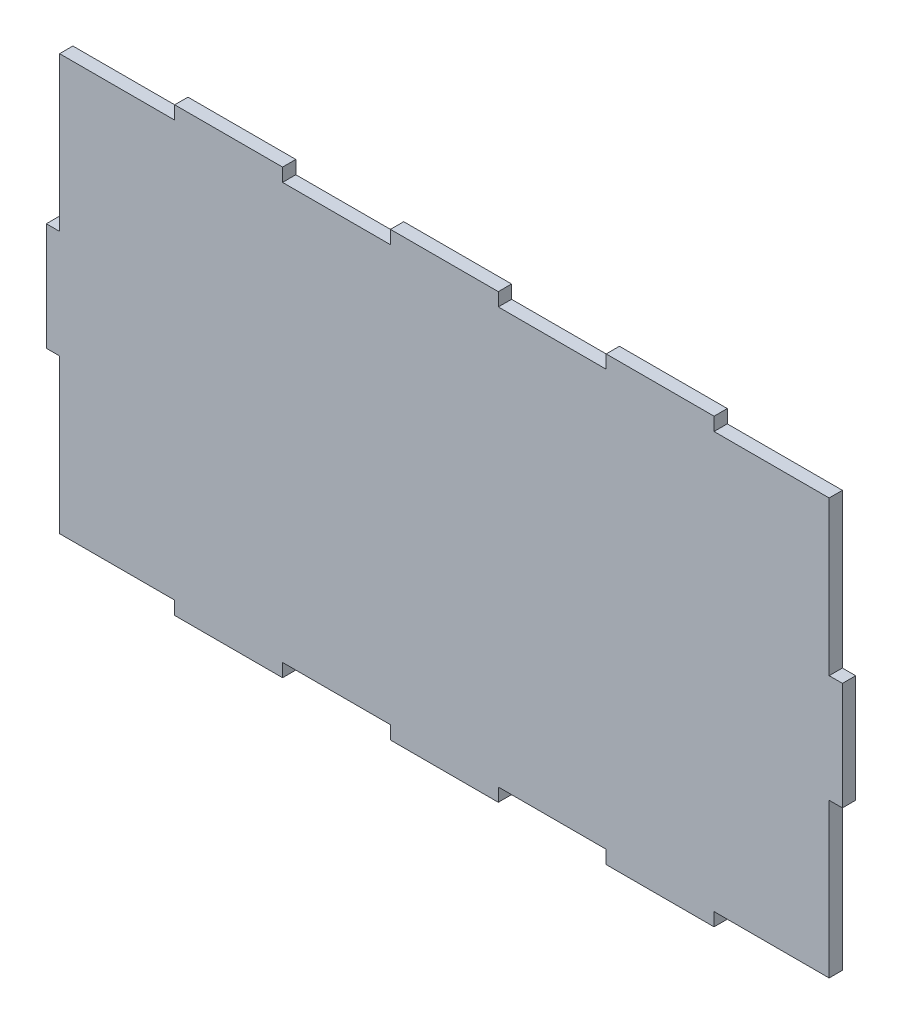
ISO-10303-21;
HEADER;
FILE_DESCRIPTION(('STEP AP214'),'2;1');
FILE_NAME('part.step','',(''),(''),'','','');
FILE_SCHEMA(('AUTOMOTIVE_DESIGN { 1 0 10303 214 1 1 1 1 }'));
ENDSEC;
DATA;
#1=APPLICATION_CONTEXT('core data for automotive mechanical design processes');
#2=APPLICATION_PROTOCOL_DEFINITION('international standard','automotive_design',2000,#1);
#3=PRODUCT_CONTEXT('',#1,'mechanical');
#4=PRODUCT('Part','Part','',(#3));
#5=PRODUCT_RELATED_PRODUCT_CATEGORY('part','',(#4));
#6=PRODUCT_DEFINITION_FORMATION('','',#4);
#7=PRODUCT_DEFINITION_CONTEXT('part definition',#1,'design');
#8=PRODUCT_DEFINITION('design','',#6,#7);
#9=PRODUCT_DEFINITION_SHAPE('','',#8);
#10=(LENGTH_UNIT() NAMED_UNIT(*) SI_UNIT(.MILLI.,.METRE.));
#11=(NAMED_UNIT(*) PLANE_ANGLE_UNIT() SI_UNIT($,.RADIAN.));
#12=(NAMED_UNIT(*) SI_UNIT($,.STERADIAN.) SOLID_ANGLE_UNIT());
#13=UNCERTAINTY_MEASURE_WITH_UNIT(LENGTH_MEASURE(1.E-05),#10,'distance_accuracy_value','');
#14=(GEOMETRIC_REPRESENTATION_CONTEXT(3) GLOBAL_UNCERTAINTY_ASSIGNED_CONTEXT((#13)) GLOBAL_UNIT_ASSIGNED_CONTEXT((#10,
#11,#12)) REPRESENTATION_CONTEXT('',''));
#15=CARTESIAN_POINT('',(0.,0.,0.));
#16=DIRECTION('',(0.,0.,1.));
#17=DIRECTION('',(1.,0.,0.));
#18=AXIS2_PLACEMENT_3D('',#15,#16,#17);
#19=CARTESIAN_POINT('',(289.,97.,3.));
#20=DIRECTION('',(1.,0.,0.));
#21=DIRECTION('',(0.,0.,-1.));
#22=AXIS2_PLACEMENT_3D('',#19,#20,#21);
#23=PLANE('',#22);
#24=DIRECTION('',(0.,-1.,0.));
#25=VECTOR('',#24,1.);
#26=CARTESIAN_POINT('',(289.,97.,0.));
#27=LINE('',#26,#25);
#28=CARTESIAN_POINT('',(289.,97.,0.));
#29=VERTEX_POINT('',#28);
#30=CARTESIAN_POINT('',(289.,62.195,0.));
#31=VERTEX_POINT('',#30);
#32=EDGE_CURVE('E301',#29,#31,#27,.T.);
#33=ORIENTED_EDGE('',*,*,#32,.T.);
#34=DIRECTION('',(0.,0.,-1.));
#35=VECTOR('',#34,1.);
#36=CARTESIAN_POINT('',(289.,62.195,3.));
#37=LINE('',#36,#35);
#38=CARTESIAN_POINT('',(289.,62.195,3.));
#39=VERTEX_POINT('',#38);
#40=EDGE_CURVE('E41',#39,#31,#37,.T.);
#41=ORIENTED_EDGE('',*,*,#40,.F.);
#42=DIRECTION('',(0.,-1.,0.));
#43=VECTOR('',#42,1.);
#44=CARTESIAN_POINT('',(289.,97.,3.));
#45=LINE('',#44,#43);
#46=CARTESIAN_POINT('',(289.,97.,3.));
#47=VERTEX_POINT('',#46);
#48=EDGE_CURVE('E177',#47,#39,#45,.T.);
#49=ORIENTED_EDGE('',*,*,#48,.F.);
#50=DIRECTION('',(0.,0.,-1.));
#51=VECTOR('',#50,1.);
#52=CARTESIAN_POINT('',(289.,97.,3.));
#53=LINE('',#52,#51);
#54=EDGE_CURVE('E11',#47,#29,#53,.T.);
#55=ORIENTED_EDGE('',*,*,#54,.T.);
#56=EDGE_LOOP('',(#33,#41,#49,#55));
#57=FACE_BOUND('',#56,.T.);
#58=ADVANCED_FACE('F33',(#57),#23,.F.);
#59=CARTESIAN_POINT('',(289.,62.195,3.));
#60=DIRECTION('',(0.,-1.,0.));
#61=DIRECTION('',(0.,0.,-1.));
#62=AXIS2_PLACEMENT_3D('',#59,#60,#61);
#63=PLANE('',#62);
#64=DIRECTION('',(-1.,0.,0.));
#65=VECTOR('',#64,1.);
#66=CARTESIAN_POINT('',(289.,62.195,0.));
#67=LINE('',#66,#65);
#68=CARTESIAN_POINT('',(286.,62.195,0.));
#69=VERTEX_POINT('',#68);
#70=EDGE_CURVE('E303',#31,#69,#67,.T.);
#71=ORIENTED_EDGE('',*,*,#70,.T.);
#72=DIRECTION('',(0.,0.,-1.));
#73=VECTOR('',#72,1.);
#74=CARTESIAN_POINT('',(286.,62.195,3.));
#75=LINE('',#74,#73);
#76=CARTESIAN_POINT('',(286.,62.195,3.));
#77=VERTEX_POINT('',#76);
#78=EDGE_CURVE('E463',#77,#69,#75,.T.);
#79=ORIENTED_EDGE('',*,*,#78,.F.);
#80=DIRECTION('',(-1.,0.,0.));
#81=VECTOR('',#80,1.);
#82=CARTESIAN_POINT('',(289.,62.195,3.));
#83=LINE('',#82,#81);
#84=EDGE_CURVE('E471',#39,#77,#83,.T.);
#85=ORIENTED_EDGE('',*,*,#84,.F.);
#86=ORIENTED_EDGE('',*,*,#40,.T.);
#87=EDGE_LOOP('',(#71,#79,#85,#86));
#88=FACE_BOUND('',#87,.T.);
#89=ADVANCED_FACE('F469',(#88),#63,.F.);
#90=CARTESIAN_POINT('',(286.,62.195,3.));
#91=DIRECTION('',(1.,0.,0.));
#92=DIRECTION('',(0.,0.,-1.));
#93=AXIS2_PLACEMENT_3D('',#90,#91,#92);
#94=PLANE('',#93);
#95=DIRECTION('',(0.,-1.,0.));
#96=VECTOR('',#95,1.);
#97=CARTESIAN_POINT('',(286.,62.195,0.));
#98=LINE('',#97,#96);
#99=CARTESIAN_POINT('',(286.,37.805,0.));
#100=VERTEX_POINT('',#99);
#101=EDGE_CURVE('E305',#69,#100,#98,.T.);
#102=ORIENTED_EDGE('',*,*,#101,.T.);
#103=DIRECTION('',(0.,0.,-1.));
#104=VECTOR('',#103,1.);
#105=CARTESIAN_POINT('',(286.,37.805,3.));
#106=LINE('',#105,#104);
#107=CARTESIAN_POINT('',(286.,37.805,3.));
#108=VERTEX_POINT('',#107);
#109=EDGE_CURVE('E460',#108,#100,#106,.T.);
#110=ORIENTED_EDGE('',*,*,#109,.F.);
#111=DIRECTION('',(0.,-1.,0.));
#112=VECTOR('',#111,1.);
#113=CARTESIAN_POINT('',(286.,62.195,3.));
#114=LINE('',#113,#112);
#115=EDGE_CURVE('E489',#77,#108,#114,.T.);
#116=ORIENTED_EDGE('',*,*,#115,.F.);
#117=ORIENTED_EDGE('',*,*,#78,.T.);
#118=EDGE_LOOP('',(#102,#110,#116,#117));
#119=FACE_BOUND('',#118,.T.);
#120=ADVANCED_FACE('F480',(#119),#94,.F.);
#121=CARTESIAN_POINT('',(286.,37.805,3.));
#122=DIRECTION('',(0.,1.,0.));
#123=DIRECTION('',(0.,0.,1.));
#124=AXIS2_PLACEMENT_3D('',#121,#122,#123);
#125=PLANE('',#124);
#126=DIRECTION('',(1.,0.,0.));
#127=VECTOR('',#126,1.);
#128=CARTESIAN_POINT('',(286.,37.805,0.));
#129=LINE('',#128,#127);
#130=CARTESIAN_POINT('',(289.,37.805,0.));
#131=VERTEX_POINT('',#130);
#132=EDGE_CURVE('E307',#100,#131,#129,.T.);
#133=ORIENTED_EDGE('',*,*,#132,.T.);
#134=DIRECTION('',(0.,0.,-1.));
#135=VECTOR('',#134,1.);
#136=CARTESIAN_POINT('',(289.,37.805,3.));
#137=LINE('',#136,#135);
#138=CARTESIAN_POINT('',(289.,37.805,3.));
#139=VERTEX_POINT('',#138);
#140=EDGE_CURVE('E457',#139,#131,#137,.T.);
#141=ORIENTED_EDGE('',*,*,#140,.F.);
#142=DIRECTION('',(1.,0.,0.));
#143=VECTOR('',#142,1.);
#144=CARTESIAN_POINT('',(286.,37.805,3.));
#145=LINE('',#144,#143);
#146=EDGE_CURVE('E486',#108,#139,#145,.T.);
#147=ORIENTED_EDGE('',*,*,#146,.F.);
#148=ORIENTED_EDGE('',*,*,#109,.T.);
#149=EDGE_LOOP('',(#133,#141,#147,#148));
#150=FACE_BOUND('',#149,.T.);
#151=ADVANCED_FACE('F484',(#150),#125,.F.);
#152=CARTESIAN_POINT('',(289.,13.415,3.));
#153=DIRECTION('',(1.,0.,0.));
#154=DIRECTION('',(0.,0.,-1.));
#155=AXIS2_PLACEMENT_3D('',#152,#153,#154);
#156=PLANE('',#155);
#157=DIRECTION('',(0.,-1.,0.));
#158=VECTOR('',#157,1.);
#159=CARTESIAN_POINT('',(289.,13.415,0.));
#160=LINE('',#159,#158);
#161=CARTESIAN_POINT('',(289.,3.,0.));
#162=VERTEX_POINT('',#161);
#163=EDGE_CURVE('E310',#131,#162,#160,.T.);
#164=ORIENTED_EDGE('',*,*,#163,.T.);
#165=DIRECTION('',(0.,0.,-1.));
#166=VECTOR('',#165,1.);
#167=CARTESIAN_POINT('',(289.,3.,3.));
#168=LINE('',#167,#166);
#169=CARTESIAN_POINT('',(289.,3.,3.));
#170=VERTEX_POINT('',#169);
#171=EDGE_CURVE('E454',#170,#162,#168,.T.);
#172=ORIENTED_EDGE('',*,*,#171,.F.);
#173=DIRECTION('',(0.,-1.,0.));
#174=VECTOR('',#173,1.);
#175=CARTESIAN_POINT('',(289.,37.805,3.));
#176=LINE('',#175,#174);
#177=EDGE_CURVE('E488',#139,#170,#176,.T.);
#178=ORIENTED_EDGE('',*,*,#177,.F.);
#179=ORIENTED_EDGE('',*,*,#140,.T.);
#180=EDGE_LOOP('',(#164,#172,#178,#179));
#181=FACE_BOUND('',#180,.T.);
#182=ADVANCED_FACE('F579',(#181),#156,.F.);
#183=CARTESIAN_POINT('',(289.,3.,3.));
#184=DIRECTION('',(0.,1.,0.));
#185=DIRECTION('',(0.,0.,1.));
#186=AXIS2_PLACEMENT_3D('',#183,#184,#185);
#187=PLANE('',#186);
#188=DIRECTION('',(1.,0.,0.));
#189=VECTOR('',#188,1.);
#190=CARTESIAN_POINT('',(289.,3.,0.));
#191=LINE('',#190,#189);
#192=CARTESIAN_POINT('',(315.025,3.,0.));
#193=VERTEX_POINT('',#192);
#194=EDGE_CURVE('E312',#162,#193,#191,.T.);
#195=ORIENTED_EDGE('',*,*,#194,.T.);
#196=DIRECTION('',(0.,0.,-1.));
#197=VECTOR('',#196,1.);
#198=CARTESIAN_POINT('',(315.025,3.,3.));
#199=LINE('',#198,#197);
#200=CARTESIAN_POINT('',(315.025,3.,3.));
#201=VERTEX_POINT('',#200);
#202=EDGE_CURVE('E451',#201,#193,#199,.T.);
#203=ORIENTED_EDGE('',*,*,#202,.F.);
#204=DIRECTION('',(1.,0.,0.));
#205=VECTOR('',#204,1.);
#206=CARTESIAN_POINT('',(289.,3.,3.));
#207=LINE('',#206,#205);
#208=EDGE_CURVE('E491',#170,#201,#207,.T.);
#209=ORIENTED_EDGE('',*,*,#208,.F.);
#210=ORIENTED_EDGE('',*,*,#171,.T.);
#211=EDGE_LOOP('',(#195,#203,#209,#210));
#212=FACE_BOUND('',#211,.T.);
#213=ADVANCED_FACE('F582',(#212),#187,.F.);
#214=CARTESIAN_POINT('',(315.025,3.,3.));
#215=DIRECTION('',(1.,0.,0.));
#216=DIRECTION('',(0.,0.,-1.));
#217=AXIS2_PLACEMENT_3D('',#214,#215,#216);
#218=PLANE('',#217);
#219=DIRECTION('',(0.,-1.,0.));
#220=VECTOR('',#219,1.);
#221=CARTESIAN_POINT('',(315.025,3.,0.));
#222=LINE('',#221,#220);
#223=CARTESIAN_POINT('',(315.025,0.,0.));
#224=VERTEX_POINT('',#223);
#225=EDGE_CURVE('E314',#193,#224,#222,.T.);
#226=ORIENTED_EDGE('',*,*,#225,.T.);
#227=DIRECTION('',(0.,0.,-1.));
#228=VECTOR('',#227,1.);
#229=CARTESIAN_POINT('',(315.025,0.,3.));
#230=LINE('',#229,#228);
#231=CARTESIAN_POINT('',(315.025,0.,3.));
#232=VERTEX_POINT('',#231);
#233=EDGE_CURVE('E448',#232,#224,#230,.T.);
#234=ORIENTED_EDGE('',*,*,#233,.F.);
#235=DIRECTION('',(0.,-1.,0.));
#236=VECTOR('',#235,1.);
#237=CARTESIAN_POINT('',(315.025,3.,3.));
#238=LINE('',#237,#236);
#239=EDGE_CURVE('E497',#201,#232,#238,.T.);
#240=ORIENTED_EDGE('',*,*,#239,.F.);
#241=ORIENTED_EDGE('',*,*,#202,.T.);
#242=EDGE_LOOP('',(#226,#234,#240,#241));
#243=FACE_BOUND('',#242,.T.);
#244=ADVANCED_FACE('F586',(#243),#218,.F.);
#245=CARTESIAN_POINT('',(315.025,0.,3.));
#246=DIRECTION('',(0.,1.,0.));
#247=DIRECTION('',(0.,0.,1.));
#248=AXIS2_PLACEMENT_3D('',#245,#246,#247);
#249=PLANE('',#248);
#250=DIRECTION('',(1.,0.,0.));
#251=VECTOR('',#250,1.);
#252=CARTESIAN_POINT('',(315.025,0.,0.));
#253=LINE('',#252,#251);
#254=CARTESIAN_POINT('',(339.415,0.,0.));
#255=VERTEX_POINT('',#254);
#256=EDGE_CURVE('E316',#224,#255,#253,.T.);
#257=ORIENTED_EDGE('',*,*,#256,.T.);
#258=DIRECTION('',(0.,0.,-1.));
#259=VECTOR('',#258,1.);
#260=CARTESIAN_POINT('',(339.415,0.,3.));
#261=LINE('',#260,#259);
#262=CARTESIAN_POINT('',(339.415,0.,3.));
#263=VERTEX_POINT('',#262);
#264=EDGE_CURVE('E445',#263,#255,#261,.T.);
#265=ORIENTED_EDGE('',*,*,#264,.F.);
#266=DIRECTION('',(1.,0.,0.));
#267=VECTOR('',#266,1.);
#268=CARTESIAN_POINT('',(315.025,0.,3.));
#269=LINE('',#268,#267);
#270=EDGE_CURVE('E499',#232,#263,#269,.T.);
#271=ORIENTED_EDGE('',*,*,#270,.F.);
#272=ORIENTED_EDGE('',*,*,#233,.T.);
#273=EDGE_LOOP('',(#257,#265,#271,#272));
#274=FACE_BOUND('',#273,.T.);
#275=ADVANCED_FACE('F590',(#274),#249,.F.);
#276=CARTESIAN_POINT('',(339.415,0.,3.));
#277=DIRECTION('',(-1.,0.,0.));
#278=DIRECTION('',(0.,0.,1.));
#279=AXIS2_PLACEMENT_3D('',#276,#277,#278);
#280=PLANE('',#279);
#281=DIRECTION('',(0.,1.,0.));
#282=VECTOR('',#281,1.);
#283=CARTESIAN_POINT('',(339.415,0.,0.));
#284=LINE('',#283,#282);
#285=CARTESIAN_POINT('',(339.415,3.,0.));
#286=VERTEX_POINT('',#285);
#287=EDGE_CURVE('E318',#255,#286,#284,.T.);
#288=ORIENTED_EDGE('',*,*,#287,.T.);
#289=DIRECTION('',(0.,0.,-1.));
#290=VECTOR('',#289,1.);
#291=CARTESIAN_POINT('',(339.415,3.,3.));
#292=LINE('',#291,#290);
#293=CARTESIAN_POINT('',(339.415,3.,3.));
#294=VERTEX_POINT('',#293);
#295=EDGE_CURVE('E442',#294,#286,#292,.T.);
#296=ORIENTED_EDGE('',*,*,#295,.F.);
#297=DIRECTION('',(0.,1.,0.));
#298=VECTOR('',#297,1.);
#299=CARTESIAN_POINT('',(339.415,0.,3.));
#300=LINE('',#299,#298);
#301=EDGE_CURVE('E501',#263,#294,#300,.T.);
#302=ORIENTED_EDGE('',*,*,#301,.F.);
#303=ORIENTED_EDGE('',*,*,#264,.T.);
#304=EDGE_LOOP('',(#288,#296,#302,#303));
#305=FACE_BOUND('',#304,.T.);
#306=ADVANCED_FACE('F594',(#305),#280,.F.);
#307=CARTESIAN_POINT('',(339.415,3.,3.));
#308=DIRECTION('',(0.,1.,0.));
#309=DIRECTION('',(0.,0.,1.));
#310=AXIS2_PLACEMENT_3D('',#307,#308,#309);
#311=PLANE('',#310);
#312=DIRECTION('',(1.,0.,0.));
#313=VECTOR('',#312,1.);
#314=CARTESIAN_POINT('',(339.415,3.,0.));
#315=LINE('',#314,#313);
#316=CARTESIAN_POINT('',(363.805,3.,0.));
#317=VERTEX_POINT('',#316);
#318=EDGE_CURVE('E320',#286,#317,#315,.T.);
#319=ORIENTED_EDGE('',*,*,#318,.T.);
#320=DIRECTION('',(0.,0.,-1.));
#321=VECTOR('',#320,1.);
#322=CARTESIAN_POINT('',(363.805,3.,3.));
#323=LINE('',#322,#321);
#324=CARTESIAN_POINT('',(363.805,3.,3.));
#325=VERTEX_POINT('',#324);
#326=EDGE_CURVE('E439',#325,#317,#323,.T.);
#327=ORIENTED_EDGE('',*,*,#326,.F.);
#328=DIRECTION('',(1.,0.,0.));
#329=VECTOR('',#328,1.);
#330=CARTESIAN_POINT('',(339.415,3.,3.));
#331=LINE('',#330,#329);
#332=EDGE_CURVE('E503',#294,#325,#331,.T.);
#333=ORIENTED_EDGE('',*,*,#332,.F.);
#334=ORIENTED_EDGE('',*,*,#295,.T.);
#335=EDGE_LOOP('',(#319,#327,#333,#334));
#336=FACE_BOUND('',#335,.T.);
#337=ADVANCED_FACE('F598',(#336),#311,.F.);
#338=CARTESIAN_POINT('',(363.805,3.,3.));
#339=DIRECTION('',(1.,0.,0.));
#340=DIRECTION('',(0.,0.,-1.));
#341=AXIS2_PLACEMENT_3D('',#338,#339,#340);
#342=PLANE('',#341);
#343=DIRECTION('',(0.,-1.,0.));
#344=VECTOR('',#343,1.);
#345=CARTESIAN_POINT('',(363.805,3.,0.));
#346=LINE('',#345,#344);
#347=CARTESIAN_POINT('',(363.805,0.,0.));
#348=VERTEX_POINT('',#347);
#349=EDGE_CURVE('E322',#317,#348,#346,.T.);
#350=ORIENTED_EDGE('',*,*,#349,.T.);
#351=DIRECTION('',(0.,0.,-1.));
#352=VECTOR('',#351,1.);
#353=CARTESIAN_POINT('',(363.805,0.,3.));
#354=LINE('',#353,#352);
#355=CARTESIAN_POINT('',(363.805,0.,3.));
#356=VERTEX_POINT('',#355);
#357=EDGE_CURVE('E436',#356,#348,#354,.T.);
#358=ORIENTED_EDGE('',*,*,#357,.F.);
#359=DIRECTION('',(0.,-1.,0.));
#360=VECTOR('',#359,1.);
#361=CARTESIAN_POINT('',(363.805,3.,3.));
#362=LINE('',#361,#360);
#363=EDGE_CURVE('E505',#325,#356,#362,.T.);
#364=ORIENTED_EDGE('',*,*,#363,.F.);
#365=ORIENTED_EDGE('',*,*,#326,.T.);
#366=EDGE_LOOP('',(#350,#358,#364,#365));
#367=FACE_BOUND('',#366,.T.);
#368=ADVANCED_FACE('F602',(#367),#342,.F.);
#369=CARTESIAN_POINT('',(363.805,0.,3.));
#370=DIRECTION('',(0.,1.,0.));
#371=DIRECTION('',(0.,0.,1.));
#372=AXIS2_PLACEMENT_3D('',#369,#370,#371);
#373=PLANE('',#372);
#374=DIRECTION('',(1.,0.,0.));
#375=VECTOR('',#374,1.);
#376=CARTESIAN_POINT('',(363.805,0.,0.));
#377=LINE('',#376,#375);
#378=CARTESIAN_POINT('',(388.195,0.,0.));
#379=VERTEX_POINT('',#378);
#380=EDGE_CURVE('E324',#348,#379,#377,.T.);
#381=ORIENTED_EDGE('',*,*,#380,.T.);
#382=DIRECTION('',(0.,0.,-1.));
#383=VECTOR('',#382,1.);
#384=CARTESIAN_POINT('',(388.195,0.,3.));
#385=LINE('',#384,#383);
#386=CARTESIAN_POINT('',(388.195,0.,3.));
#387=VERTEX_POINT('',#386);
#388=EDGE_CURVE('E433',#387,#379,#385,.T.);
#389=ORIENTED_EDGE('',*,*,#388,.F.);
#390=DIRECTION('',(1.,0.,0.));
#391=VECTOR('',#390,1.);
#392=CARTESIAN_POINT('',(363.805,0.,3.));
#393=LINE('',#392,#391);
#394=EDGE_CURVE('E507',#356,#387,#393,.T.);
#395=ORIENTED_EDGE('',*,*,#394,.F.);
#396=ORIENTED_EDGE('',*,*,#357,.T.);
#397=EDGE_LOOP('',(#381,#389,#395,#396));
#398=FACE_BOUND('',#397,.T.);
#399=ADVANCED_FACE('F606',(#398),#373,.F.);
#400=CARTESIAN_POINT('',(388.195,0.,3.));
#401=DIRECTION('',(-1.,0.,0.));
#402=DIRECTION('',(0.,0.,1.));
#403=AXIS2_PLACEMENT_3D('',#400,#401,#402);
#404=PLANE('',#403);
#405=DIRECTION('',(0.,1.,0.));
#406=VECTOR('',#405,1.);
#407=CARTESIAN_POINT('',(388.195,0.,0.));
#408=LINE('',#407,#406);
#409=CARTESIAN_POINT('',(388.195,3.,0.));
#410=VERTEX_POINT('',#409);
#411=EDGE_CURVE('E326',#379,#410,#408,.T.);
#412=ORIENTED_EDGE('',*,*,#411,.T.);
#413=DIRECTION('',(0.,0.,-1.));
#414=VECTOR('',#413,1.);
#415=CARTESIAN_POINT('',(388.195,3.,3.));
#416=LINE('',#415,#414);
#417=CARTESIAN_POINT('',(388.195,3.,3.));
#418=VERTEX_POINT('',#417);
#419=EDGE_CURVE('E430',#418,#410,#416,.T.);
#420=ORIENTED_EDGE('',*,*,#419,.F.);
#421=DIRECTION('',(0.,1.,0.));
#422=VECTOR('',#421,1.);
#423=CARTESIAN_POINT('',(388.195,0.,3.));
#424=LINE('',#423,#422);
#425=EDGE_CURVE('E509',#387,#418,#424,.T.);
#426=ORIENTED_EDGE('',*,*,#425,.F.);
#427=ORIENTED_EDGE('',*,*,#388,.T.);
#428=EDGE_LOOP('',(#412,#420,#426,#427));
#429=FACE_BOUND('',#428,.T.);
#430=ADVANCED_FACE('F610',(#429),#404,.F.);
#431=CARTESIAN_POINT('',(388.195,3.,3.));
#432=DIRECTION('',(0.,1.,0.));
#433=DIRECTION('',(0.,0.,1.));
#434=AXIS2_PLACEMENT_3D('',#431,#432,#433);
#435=PLANE('',#434);
#436=DIRECTION('',(1.,0.,0.));
#437=VECTOR('',#436,1.);
#438=CARTESIAN_POINT('',(388.195,3.,0.));
#439=LINE('',#438,#437);
#440=CARTESIAN_POINT('',(412.585,3.,0.));
#441=VERTEX_POINT('',#440);
#442=EDGE_CURVE('E328',#410,#441,#439,.T.);
#443=ORIENTED_EDGE('',*,*,#442,.T.);
#444=DIRECTION('',(0.,0.,-1.));
#445=VECTOR('',#444,1.);
#446=CARTESIAN_POINT('',(412.585,3.,3.));
#447=LINE('',#446,#445);
#448=CARTESIAN_POINT('',(412.585,3.,3.));
#449=VERTEX_POINT('',#448);
#450=EDGE_CURVE('E427',#449,#441,#447,.T.);
#451=ORIENTED_EDGE('',*,*,#450,.F.);
#452=DIRECTION('',(1.,0.,0.));
#453=VECTOR('',#452,1.);
#454=CARTESIAN_POINT('',(388.195,3.,3.));
#455=LINE('',#454,#453);
#456=EDGE_CURVE('E511',#418,#449,#455,.T.);
#457=ORIENTED_EDGE('',*,*,#456,.F.);
#458=ORIENTED_EDGE('',*,*,#419,.T.);
#459=EDGE_LOOP('',(#443,#451,#457,#458));
#460=FACE_BOUND('',#459,.T.);
#461=ADVANCED_FACE('F614',(#460),#435,.F.);
#462=CARTESIAN_POINT('',(412.585,3.,3.));
#463=DIRECTION('',(1.,0.,0.));
#464=DIRECTION('',(0.,0.,-1.));
#465=AXIS2_PLACEMENT_3D('',#462,#463,#464);
#466=PLANE('',#465);
#467=DIRECTION('',(0.,-1.,0.));
#468=VECTOR('',#467,1.);
#469=CARTESIAN_POINT('',(412.585,3.,0.));
#470=LINE('',#469,#468);
#471=CARTESIAN_POINT('',(412.585,0.,0.));
#472=VERTEX_POINT('',#471);
#473=EDGE_CURVE('E330',#441,#472,#470,.T.);
#474=ORIENTED_EDGE('',*,*,#473,.T.);
#475=DIRECTION('',(0.,0.,-1.));
#476=VECTOR('',#475,1.);
#477=CARTESIAN_POINT('',(412.585,0.,3.));
#478=LINE('',#477,#476);
#479=CARTESIAN_POINT('',(412.585,0.,3.));
#480=VERTEX_POINT('',#479);
#481=EDGE_CURVE('E424',#480,#472,#478,.T.);
#482=ORIENTED_EDGE('',*,*,#481,.F.);
#483=DIRECTION('',(0.,-1.,0.));
#484=VECTOR('',#483,1.);
#485=CARTESIAN_POINT('',(412.585,3.,3.));
#486=LINE('',#485,#484);
#487=EDGE_CURVE('E513',#449,#480,#486,.T.);
#488=ORIENTED_EDGE('',*,*,#487,.F.);
#489=ORIENTED_EDGE('',*,*,#450,.T.);
#490=EDGE_LOOP('',(#474,#482,#488,#489));
#491=FACE_BOUND('',#490,.T.);
#492=ADVANCED_FACE('F618',(#491),#466,.F.);
#493=CARTESIAN_POINT('',(412.585,0.,3.));
#494=DIRECTION('',(0.,1.,0.));
#495=DIRECTION('',(0.,0.,1.));
#496=AXIS2_PLACEMENT_3D('',#493,#494,#495);
#497=PLANE('',#496);
#498=DIRECTION('',(1.,0.,0.));
#499=VECTOR('',#498,1.);
#500=CARTESIAN_POINT('',(412.585,0.,0.));
#501=LINE('',#500,#499);
#502=CARTESIAN_POINT('',(436.975,0.,0.));
#503=VERTEX_POINT('',#502);
#504=EDGE_CURVE('E332',#472,#503,#501,.T.);
#505=ORIENTED_EDGE('',*,*,#504,.T.);
#506=DIRECTION('',(0.,0.,-1.));
#507=VECTOR('',#506,1.);
#508=CARTESIAN_POINT('',(436.975,0.,3.));
#509=LINE('',#508,#507);
#510=CARTESIAN_POINT('',(436.975,0.,3.));
#511=VERTEX_POINT('',#510);
#512=EDGE_CURVE('E421',#511,#503,#509,.T.);
#513=ORIENTED_EDGE('',*,*,#512,.F.);
#514=DIRECTION('',(1.,0.,0.));
#515=VECTOR('',#514,1.);
#516=CARTESIAN_POINT('',(412.585,0.,3.));
#517=LINE('',#516,#515);
#518=EDGE_CURVE('E515',#480,#511,#517,.T.);
#519=ORIENTED_EDGE('',*,*,#518,.F.);
#520=ORIENTED_EDGE('',*,*,#481,.T.);
#521=EDGE_LOOP('',(#505,#513,#519,#520));
#522=FACE_BOUND('',#521,.T.);
#523=ADVANCED_FACE('F622',(#522),#497,.F.);
#524=CARTESIAN_POINT('',(436.975,0.,3.));
#525=DIRECTION('',(-1.,0.,0.));
#526=DIRECTION('',(0.,0.,1.));
#527=AXIS2_PLACEMENT_3D('',#524,#525,#526);
#528=PLANE('',#527);
#529=DIRECTION('',(0.,1.,0.));
#530=VECTOR('',#529,1.);
#531=CARTESIAN_POINT('',(436.975,0.,0.));
#532=LINE('',#531,#530);
#533=CARTESIAN_POINT('',(436.975,3.,0.));
#534=VERTEX_POINT('',#533);
#535=EDGE_CURVE('E334',#503,#534,#532,.T.);
#536=ORIENTED_EDGE('',*,*,#535,.T.);
#537=DIRECTION('',(0.,0.,-1.));
#538=VECTOR('',#537,1.);
#539=CARTESIAN_POINT('',(436.975,3.,3.));
#540=LINE('',#539,#538);
#541=CARTESIAN_POINT('',(436.975,3.,3.));
#542=VERTEX_POINT('',#541);
#543=EDGE_CURVE('E418',#542,#534,#540,.T.);
#544=ORIENTED_EDGE('',*,*,#543,.F.);
#545=DIRECTION('',(0.,1.,0.));
#546=VECTOR('',#545,1.);
#547=CARTESIAN_POINT('',(436.975,0.,3.));
#548=LINE('',#547,#546);
#549=EDGE_CURVE('E517',#511,#542,#548,.T.);
#550=ORIENTED_EDGE('',*,*,#549,.F.);
#551=ORIENTED_EDGE('',*,*,#512,.T.);
#552=EDGE_LOOP('',(#536,#544,#550,#551));
#553=FACE_BOUND('',#552,.T.);
#554=ADVANCED_FACE('F626',(#553),#528,.F.);
#555=CARTESIAN_POINT('',(461.365,3.,3.));
#556=DIRECTION('',(0.,1.,0.));
#557=DIRECTION('',(0.,0.,1.));
#558=AXIS2_PLACEMENT_3D('',#555,#556,#557);
#559=PLANE('',#558);
#560=DIRECTION('',(1.,0.,0.));
#561=VECTOR('',#560,1.);
#562=CARTESIAN_POINT('',(461.365,3.,0.));
#563=LINE('',#562,#561);
#564=CARTESIAN_POINT('',(463.,3.,0.));
#565=VERTEX_POINT('',#564);
#566=EDGE_CURVE('E337',#534,#565,#563,.T.);
#567=ORIENTED_EDGE('',*,*,#566,.T.);
#568=DIRECTION('',(0.,0.,-1.));
#569=VECTOR('',#568,1.);
#570=CARTESIAN_POINT('',(463.,3.,3.));
#571=LINE('',#570,#569);
#572=CARTESIAN_POINT('',(463.,3.,3.));
#573=VERTEX_POINT('',#572);
#574=EDGE_CURVE('E415',#573,#565,#571,.T.);
#575=ORIENTED_EDGE('',*,*,#574,.F.);
#576=DIRECTION('',(1.,0.,0.));
#577=VECTOR('',#576,1.);
#578=CARTESIAN_POINT('',(436.975,3.,3.));
#579=LINE('',#578,#577);
#580=EDGE_CURVE('E519',#542,#573,#579,.T.);
#581=ORIENTED_EDGE('',*,*,#580,.F.);
#582=ORIENTED_EDGE('',*,*,#543,.T.);
#583=EDGE_LOOP('',(#567,#575,#581,#582));
#584=FACE_BOUND('',#583,.T.);
#585=ADVANCED_FACE('F630',(#584),#559,.F.);
#586=CARTESIAN_POINT('',(463.,3.,3.));
#587=DIRECTION('',(-1.,0.,0.));
#588=DIRECTION('',(0.,0.,1.));
#589=AXIS2_PLACEMENT_3D('',#586,#587,#588);
#590=PLANE('',#589);
#591=DIRECTION('',(0.,1.,0.));
#592=VECTOR('',#591,1.);
#593=CARTESIAN_POINT('',(463.,3.,0.));
#594=LINE('',#593,#592);
#595=CARTESIAN_POINT('',(463.,37.805,0.));
#596=VERTEX_POINT('',#595);
#597=EDGE_CURVE('E339',#565,#596,#594,.T.);
#598=ORIENTED_EDGE('',*,*,#597,.T.);
#599=DIRECTION('',(0.,0.,-1.));
#600=VECTOR('',#599,1.);
#601=CARTESIAN_POINT('',(463.,37.805,3.));
#602=LINE('',#601,#600);
#603=CARTESIAN_POINT('',(463.,37.805,3.));
#604=VERTEX_POINT('',#603);
#605=EDGE_CURVE('E412',#604,#596,#602,.T.);
#606=ORIENTED_EDGE('',*,*,#605,.F.);
#607=DIRECTION('',(0.,1.,0.));
#608=VECTOR('',#607,1.);
#609=CARTESIAN_POINT('',(463.,3.,3.));
#610=LINE('',#609,#608);
#611=EDGE_CURVE('E521',#573,#604,#610,.T.);
#612=ORIENTED_EDGE('',*,*,#611,.F.);
#613=ORIENTED_EDGE('',*,*,#574,.T.);
#614=EDGE_LOOP('',(#598,#606,#612,#613));
#615=FACE_BOUND('',#614,.T.);
#616=ADVANCED_FACE('F634',(#615),#590,.F.);
#617=CARTESIAN_POINT('',(463.,37.805,3.));
#618=DIRECTION('',(0.,1.,0.));
#619=DIRECTION('',(0.,0.,1.));
#620=AXIS2_PLACEMENT_3D('',#617,#618,#619);
#621=PLANE('',#620);
#622=DIRECTION('',(1.,0.,0.));
#623=VECTOR('',#622,1.);
#624=CARTESIAN_POINT('',(463.,37.805,0.));
#625=LINE('',#624,#623);
#626=CARTESIAN_POINT('',(466.,37.805,0.));
#627=VERTEX_POINT('',#626);
#628=EDGE_CURVE('E341',#596,#627,#625,.T.);
#629=ORIENTED_EDGE('',*,*,#628,.T.);
#630=DIRECTION('',(0.,0.,-1.));
#631=VECTOR('',#630,1.);
#632=CARTESIAN_POINT('',(466.,37.805,3.));
#633=LINE('',#632,#631);
#634=CARTESIAN_POINT('',(466.,37.805,3.));
#635=VERTEX_POINT('',#634);
#636=EDGE_CURVE('E409',#635,#627,#633,.T.);
#637=ORIENTED_EDGE('',*,*,#636,.F.);
#638=DIRECTION('',(1.,0.,0.));
#639=VECTOR('',#638,1.);
#640=CARTESIAN_POINT('',(463.,37.805,3.));
#641=LINE('',#640,#639);
#642=EDGE_CURVE('E523',#604,#635,#641,.T.);
#643=ORIENTED_EDGE('',*,*,#642,.F.);
#644=ORIENTED_EDGE('',*,*,#605,.T.);
#645=EDGE_LOOP('',(#629,#637,#643,#644));
#646=FACE_BOUND('',#645,.T.);
#647=ADVANCED_FACE('F638',(#646),#621,.F.);
#648=CARTESIAN_POINT('',(466.,37.805,3.));
#649=DIRECTION('',(-1.,0.,0.));
#650=DIRECTION('',(0.,0.,1.));
#651=AXIS2_PLACEMENT_3D('',#648,#649,#650);
#652=PLANE('',#651);
#653=DIRECTION('',(0.,1.,0.));
#654=VECTOR('',#653,1.);
#655=CARTESIAN_POINT('',(466.,37.805,0.));
#656=LINE('',#655,#654);
#657=CARTESIAN_POINT('',(466.,62.195,0.));
#658=VERTEX_POINT('',#657);
#659=EDGE_CURVE('E343',#627,#658,#656,.T.);
#660=ORIENTED_EDGE('',*,*,#659,.T.);
#661=DIRECTION('',(0.,0.,-1.));
#662=VECTOR('',#661,1.);
#663=CARTESIAN_POINT('',(466.,62.195,3.));
#664=LINE('',#663,#662);
#665=CARTESIAN_POINT('',(466.,62.195,3.));
#666=VERTEX_POINT('',#665);
#667=EDGE_CURVE('E406',#666,#658,#664,.T.);
#668=ORIENTED_EDGE('',*,*,#667,.F.);
#669=DIRECTION('',(0.,1.,0.));
#670=VECTOR('',#669,1.);
#671=CARTESIAN_POINT('',(466.,37.805,3.));
#672=LINE('',#671,#670);
#673=EDGE_CURVE('E525',#635,#666,#672,.T.);
#674=ORIENTED_EDGE('',*,*,#673,.F.);
#675=ORIENTED_EDGE('',*,*,#636,.T.);
#676=EDGE_LOOP('',(#660,#668,#674,#675));
#677=FACE_BOUND('',#676,.T.);
#678=ADVANCED_FACE('F642',(#677),#652,.F.);
#679=CARTESIAN_POINT('',(466.,62.195,3.));
#680=DIRECTION('',(0.,-1.,0.));
#681=DIRECTION('',(0.,0.,-1.));
#682=AXIS2_PLACEMENT_3D('',#679,#680,#681);
#683=PLANE('',#682);
#684=DIRECTION('',(-1.,0.,0.));
#685=VECTOR('',#684,1.);
#686=CARTESIAN_POINT('',(466.,62.195,0.));
#687=LINE('',#686,#685);
#688=CARTESIAN_POINT('',(463.,62.195,0.));
#689=VERTEX_POINT('',#688);
#690=EDGE_CURVE('E345',#658,#689,#687,.T.);
#691=ORIENTED_EDGE('',*,*,#690,.T.);
#692=DIRECTION('',(0.,0.,-1.));
#693=VECTOR('',#692,1.);
#694=CARTESIAN_POINT('',(463.,62.195,3.));
#695=LINE('',#694,#693);
#696=CARTESIAN_POINT('',(463.,62.195,3.));
#697=VERTEX_POINT('',#696);
#698=EDGE_CURVE('E403',#697,#689,#695,.T.);
#699=ORIENTED_EDGE('',*,*,#698,.F.);
#700=DIRECTION('',(-1.,0.,0.));
#701=VECTOR('',#700,1.);
#702=CARTESIAN_POINT('',(466.,62.195,3.));
#703=LINE('',#702,#701);
#704=EDGE_CURVE('E527',#666,#697,#703,.T.);
#705=ORIENTED_EDGE('',*,*,#704,.F.);
#706=ORIENTED_EDGE('',*,*,#667,.T.);
#707=EDGE_LOOP('',(#691,#699,#705,#706));
#708=FACE_BOUND('',#707,.T.);
#709=ADVANCED_FACE('F646',(#708),#683,.F.);
#710=CARTESIAN_POINT('',(463.,86.585,3.));
#711=DIRECTION('',(-1.,0.,0.));
#712=DIRECTION('',(0.,0.,1.));
#713=AXIS2_PLACEMENT_3D('',#710,#711,#712);
#714=PLANE('',#713);
#715=DIRECTION('',(0.,1.,0.));
#716=VECTOR('',#715,1.);
#717=CARTESIAN_POINT('',(463.,86.585,0.));
#718=LINE('',#717,#716);
#719=CARTESIAN_POINT('',(463.,97.,0.));
#720=VERTEX_POINT('',#719);
#721=EDGE_CURVE('E348',#689,#720,#718,.T.);
#722=ORIENTED_EDGE('',*,*,#721,.T.);
#723=DIRECTION('',(0.,0.,-1.));
#724=VECTOR('',#723,1.);
#725=CARTESIAN_POINT('',(463.,97.,3.));
#726=LINE('',#725,#724);
#727=CARTESIAN_POINT('',(463.,97.,3.));
#728=VERTEX_POINT('',#727);
#729=EDGE_CURVE('E400',#728,#720,#726,.T.);
#730=ORIENTED_EDGE('',*,*,#729,.F.);
#731=DIRECTION('',(0.,1.,0.));
#732=VECTOR('',#731,1.);
#733=CARTESIAN_POINT('',(463.,62.195,3.));
#734=LINE('',#733,#732);
#735=EDGE_CURVE('E529',#697,#728,#734,.T.);
#736=ORIENTED_EDGE('',*,*,#735,.F.);
#737=ORIENTED_EDGE('',*,*,#698,.T.);
#738=EDGE_LOOP('',(#722,#730,#736,#737));
#739=FACE_BOUND('',#738,.T.);
#740=ADVANCED_FACE('F650',(#739),#714,.F.);
#741=CARTESIAN_POINT('',(463.,97.,3.));
#742=DIRECTION('',(0.,-1.,0.));
#743=DIRECTION('',(0.,0.,-1.));
#744=AXIS2_PLACEMENT_3D('',#741,#742,#743);
#745=PLANE('',#744);
#746=DIRECTION('',(-1.,0.,0.));
#747=VECTOR('',#746,1.);
#748=CARTESIAN_POINT('',(463.,97.,0.));
#749=LINE('',#748,#747);
#750=CARTESIAN_POINT('',(436.975,97.,0.));
#751=VERTEX_POINT('',#750);
#752=EDGE_CURVE('E350',#720,#751,#749,.T.);
#753=ORIENTED_EDGE('',*,*,#752,.T.);
#754=DIRECTION('',(0.,0.,-1.));
#755=VECTOR('',#754,1.);
#756=CARTESIAN_POINT('',(436.975,97.,3.));
#757=LINE('',#756,#755);
#758=CARTESIAN_POINT('',(436.975,97.,3.));
#759=VERTEX_POINT('',#758);
#760=EDGE_CURVE('E397',#759,#751,#757,.T.);
#761=ORIENTED_EDGE('',*,*,#760,.F.);
#762=DIRECTION('',(-1.,0.,0.));
#763=VECTOR('',#762,1.);
#764=CARTESIAN_POINT('',(463.,97.,3.));
#765=LINE('',#764,#763);
#766=EDGE_CURVE('E531',#728,#759,#765,.T.);
#767=ORIENTED_EDGE('',*,*,#766,.F.);
#768=ORIENTED_EDGE('',*,*,#729,.T.);
#769=EDGE_LOOP('',(#753,#761,#767,#768));
#770=FACE_BOUND('',#769,.T.);
#771=ADVANCED_FACE('F654',(#770),#745,.F.);
#772=CARTESIAN_POINT('',(436.975,97.,3.));
#773=DIRECTION('',(-1.,0.,0.));
#774=DIRECTION('',(0.,0.,1.));
#775=AXIS2_PLACEMENT_3D('',#772,#773,#774);
#776=PLANE('',#775);
#777=DIRECTION('',(0.,1.,0.));
#778=VECTOR('',#777,1.);
#779=CARTESIAN_POINT('',(436.975,97.,0.));
#780=LINE('',#779,#778);
#781=CARTESIAN_POINT('',(436.975,100.,0.));
#782=VERTEX_POINT('',#781);
#783=EDGE_CURVE('E352',#751,#782,#780,.T.);
#784=ORIENTED_EDGE('',*,*,#783,.T.);
#785=DIRECTION('',(0.,0.,-1.));
#786=VECTOR('',#785,1.);
#787=CARTESIAN_POINT('',(436.975,100.,3.));
#788=LINE('',#787,#786);
#789=CARTESIAN_POINT('',(436.975,100.,3.));
#790=VERTEX_POINT('',#789);
#791=EDGE_CURVE('E394',#790,#782,#788,.T.);
#792=ORIENTED_EDGE('',*,*,#791,.F.);
#793=DIRECTION('',(0.,1.,0.));
#794=VECTOR('',#793,1.);
#795=CARTESIAN_POINT('',(436.975,97.,3.));
#796=LINE('',#795,#794);
#797=EDGE_CURVE('E533',#759,#790,#796,.T.);
#798=ORIENTED_EDGE('',*,*,#797,.F.);
#799=ORIENTED_EDGE('',*,*,#760,.T.);
#800=EDGE_LOOP('',(#784,#792,#798,#799));
#801=FACE_BOUND('',#800,.T.);
#802=ADVANCED_FACE('F658',(#801),#776,.F.);
#803=CARTESIAN_POINT('',(436.975,100.,3.));
#804=DIRECTION('',(0.,-1.,0.));
#805=DIRECTION('',(0.,0.,-1.));
#806=AXIS2_PLACEMENT_3D('',#803,#804,#805);
#807=PLANE('',#806);
#808=DIRECTION('',(-1.,0.,0.));
#809=VECTOR('',#808,1.);
#810=CARTESIAN_POINT('',(436.975,100.,0.));
#811=LINE('',#810,#809);
#812=CARTESIAN_POINT('',(412.585,100.,0.));
#813=VERTEX_POINT('',#812);
#814=EDGE_CURVE('E354',#782,#813,#811,.T.);
#815=ORIENTED_EDGE('',*,*,#814,.T.);
#816=DIRECTION('',(0.,0.,-1.));
#817=VECTOR('',#816,1.);
#818=CARTESIAN_POINT('',(412.585,100.,3.));
#819=LINE('',#818,#817);
#820=CARTESIAN_POINT('',(412.585,100.,3.));
#821=VERTEX_POINT('',#820);
#822=EDGE_CURVE('E391',#821,#813,#819,.T.);
#823=ORIENTED_EDGE('',*,*,#822,.F.);
#824=DIRECTION('',(-1.,0.,0.));
#825=VECTOR('',#824,1.);
#826=CARTESIAN_POINT('',(436.975,100.,3.));
#827=LINE('',#826,#825);
#828=EDGE_CURVE('E535',#790,#821,#827,.T.);
#829=ORIENTED_EDGE('',*,*,#828,.F.);
#830=ORIENTED_EDGE('',*,*,#791,.T.);
#831=EDGE_LOOP('',(#815,#823,#829,#830));
#832=FACE_BOUND('',#831,.T.);
#833=ADVANCED_FACE('F662',(#832),#807,.F.);
#834=CARTESIAN_POINT('',(412.585,100.,3.));
#835=DIRECTION('',(1.,0.,0.));
#836=DIRECTION('',(0.,0.,-1.));
#837=AXIS2_PLACEMENT_3D('',#834,#835,#836);
#838=PLANE('',#837);
#839=DIRECTION('',(0.,-1.,0.));
#840=VECTOR('',#839,1.);
#841=CARTESIAN_POINT('',(412.585,100.,0.));
#842=LINE('',#841,#840);
#843=CARTESIAN_POINT('',(412.585,97.,0.));
#844=VERTEX_POINT('',#843);
#845=EDGE_CURVE('E356',#813,#844,#842,.T.);
#846=ORIENTED_EDGE('',*,*,#845,.T.);
#847=DIRECTION('',(0.,0.,-1.));
#848=VECTOR('',#847,1.);
#849=CARTESIAN_POINT('',(412.585,97.,3.));
#850=LINE('',#849,#848);
#851=CARTESIAN_POINT('',(412.585,97.,3.));
#852=VERTEX_POINT('',#851);
#853=EDGE_CURVE('E388',#852,#844,#850,.T.);
#854=ORIENTED_EDGE('',*,*,#853,.F.);
#855=DIRECTION('',(0.,-1.,0.));
#856=VECTOR('',#855,1.);
#857=CARTESIAN_POINT('',(412.585,100.,3.));
#858=LINE('',#857,#856);
#859=EDGE_CURVE('E537',#821,#852,#858,.T.);
#860=ORIENTED_EDGE('',*,*,#859,.F.);
#861=ORIENTED_EDGE('',*,*,#822,.T.);
#862=EDGE_LOOP('',(#846,#854,#860,#861));
#863=FACE_BOUND('',#862,.T.);
#864=ADVANCED_FACE('F666',(#863),#838,.F.);
#865=CARTESIAN_POINT('',(412.585,97.,3.));
#866=DIRECTION('',(0.,-1.,0.));
#867=DIRECTION('',(0.,0.,-1.));
#868=AXIS2_PLACEMENT_3D('',#865,#866,#867);
#869=PLANE('',#868);
#870=DIRECTION('',(-1.,0.,0.));
#871=VECTOR('',#870,1.);
#872=CARTESIAN_POINT('',(412.585,97.,0.));
#873=LINE('',#872,#871);
#874=CARTESIAN_POINT('',(388.195,97.,0.));
#875=VERTEX_POINT('',#874);
#876=EDGE_CURVE('E358',#844,#875,#873,.T.);
#877=ORIENTED_EDGE('',*,*,#876,.T.);
#878=DIRECTION('',(0.,0.,-1.));
#879=VECTOR('',#878,1.);
#880=CARTESIAN_POINT('',(388.195,97.,3.));
#881=LINE('',#880,#879);
#882=CARTESIAN_POINT('',(388.195,97.,3.));
#883=VERTEX_POINT('',#882);
#884=EDGE_CURVE('E385',#883,#875,#881,.T.);
#885=ORIENTED_EDGE('',*,*,#884,.F.);
#886=DIRECTION('',(-1.,0.,0.));
#887=VECTOR('',#886,1.);
#888=CARTESIAN_POINT('',(412.585,97.,3.));
#889=LINE('',#888,#887);
#890=EDGE_CURVE('E539',#852,#883,#889,.T.);
#891=ORIENTED_EDGE('',*,*,#890,.F.);
#892=ORIENTED_EDGE('',*,*,#853,.T.);
#893=EDGE_LOOP('',(#877,#885,#891,#892));
#894=FACE_BOUND('',#893,.T.);
#895=ADVANCED_FACE('F670',(#894),#869,.F.);
#896=CARTESIAN_POINT('',(388.195,97.,3.));
#897=DIRECTION('',(-1.,0.,0.));
#898=DIRECTION('',(0.,0.,1.));
#899=AXIS2_PLACEMENT_3D('',#896,#897,#898);
#900=PLANE('',#899);
#901=DIRECTION('',(0.,1.,0.));
#902=VECTOR('',#901,1.);
#903=CARTESIAN_POINT('',(388.195,97.,0.));
#904=LINE('',#903,#902);
#905=CARTESIAN_POINT('',(388.195,100.,0.));
#906=VERTEX_POINT('',#905);
#907=EDGE_CURVE('E360',#875,#906,#904,.T.);
#908=ORIENTED_EDGE('',*,*,#907,.T.);
#909=DIRECTION('',(0.,0.,-1.));
#910=VECTOR('',#909,1.);
#911=CARTESIAN_POINT('',(388.195,100.,3.));
#912=LINE('',#911,#910);
#913=CARTESIAN_POINT('',(388.195,100.,3.));
#914=VERTEX_POINT('',#913);
#915=EDGE_CURVE('E382',#914,#906,#912,.T.);
#916=ORIENTED_EDGE('',*,*,#915,.F.);
#917=DIRECTION('',(0.,1.,0.));
#918=VECTOR('',#917,1.);
#919=CARTESIAN_POINT('',(388.195,97.,3.));
#920=LINE('',#919,#918);
#921=EDGE_CURVE('E541',#883,#914,#920,.T.);
#922=ORIENTED_EDGE('',*,*,#921,.F.);
#923=ORIENTED_EDGE('',*,*,#884,.T.);
#924=EDGE_LOOP('',(#908,#916,#922,#923));
#925=FACE_BOUND('',#924,.T.);
#926=ADVANCED_FACE('F674',(#925),#900,.F.);
#927=CARTESIAN_POINT('',(388.195,100.,3.));
#928=DIRECTION('',(0.,-1.,0.));
#929=DIRECTION('',(0.,0.,-1.));
#930=AXIS2_PLACEMENT_3D('',#927,#928,#929);
#931=PLANE('',#930);
#932=DIRECTION('',(-1.,0.,0.));
#933=VECTOR('',#932,1.);
#934=CARTESIAN_POINT('',(388.195,100.,0.));
#935=LINE('',#934,#933);
#936=CARTESIAN_POINT('',(363.805,100.,0.));
#937=VERTEX_POINT('',#936);
#938=EDGE_CURVE('E362',#906,#937,#935,.T.);
#939=ORIENTED_EDGE('',*,*,#938,.T.);
#940=DIRECTION('',(0.,0.,-1.));
#941=VECTOR('',#940,1.);
#942=CARTESIAN_POINT('',(363.805,100.,3.));
#943=LINE('',#942,#941);
#944=CARTESIAN_POINT('',(363.805,100.,3.));
#945=VERTEX_POINT('',#944);
#946=EDGE_CURVE('E379',#945,#937,#943,.T.);
#947=ORIENTED_EDGE('',*,*,#946,.F.);
#948=DIRECTION('',(-1.,0.,0.));
#949=VECTOR('',#948,1.);
#950=CARTESIAN_POINT('',(388.195,100.,3.));
#951=LINE('',#950,#949);
#952=EDGE_CURVE('E543',#914,#945,#951,.T.);
#953=ORIENTED_EDGE('',*,*,#952,.F.);
#954=ORIENTED_EDGE('',*,*,#915,.T.);
#955=EDGE_LOOP('',(#939,#947,#953,#954));
#956=FACE_BOUND('',#955,.T.);
#957=ADVANCED_FACE('F678',(#956),#931,.F.);
#958=CARTESIAN_POINT('',(363.805,100.,3.));
#959=DIRECTION('',(1.,0.,0.));
#960=DIRECTION('',(0.,0.,-1.));
#961=AXIS2_PLACEMENT_3D('',#958,#959,#960);
#962=PLANE('',#961);
#963=DIRECTION('',(0.,-1.,0.));
#964=VECTOR('',#963,1.);
#965=CARTESIAN_POINT('',(363.805,100.,0.));
#966=LINE('',#965,#964);
#967=CARTESIAN_POINT('',(363.805,97.,0.));
#968=VERTEX_POINT('',#967);
#969=EDGE_CURVE('E364',#937,#968,#966,.T.);
#970=ORIENTED_EDGE('',*,*,#969,.T.);
#971=DIRECTION('',(0.,0.,-1.));
#972=VECTOR('',#971,1.);
#973=CARTESIAN_POINT('',(363.805,97.,3.));
#974=LINE('',#973,#972);
#975=CARTESIAN_POINT('',(363.805,97.,3.));
#976=VERTEX_POINT('',#975);
#977=EDGE_CURVE('E376',#976,#968,#974,.T.);
#978=ORIENTED_EDGE('',*,*,#977,.F.);
#979=DIRECTION('',(0.,-1.,0.));
#980=VECTOR('',#979,1.);
#981=CARTESIAN_POINT('',(363.805,100.,3.));
#982=LINE('',#981,#980);
#983=EDGE_CURVE('E545',#945,#976,#982,.T.);
#984=ORIENTED_EDGE('',*,*,#983,.F.);
#985=ORIENTED_EDGE('',*,*,#946,.T.);
#986=EDGE_LOOP('',(#970,#978,#984,#985));
#987=FACE_BOUND('',#986,.T.);
#988=ADVANCED_FACE('F551',(#987),#962,.F.);
#989=CARTESIAN_POINT('',(363.805,97.,3.));
#990=DIRECTION('',(0.,-1.,0.));
#991=DIRECTION('',(0.,0.,-1.));
#992=AXIS2_PLACEMENT_3D('',#989,#990,#991);
#993=PLANE('',#992);
#994=DIRECTION('',(-1.,0.,0.));
#995=VECTOR('',#994,1.);
#996=CARTESIAN_POINT('',(363.805,97.,0.));
#997=LINE('',#996,#995);
#998=CARTESIAN_POINT('',(339.415,97.,0.));
#999=VERTEX_POINT('',#998);
#1000=EDGE_CURVE('E366',#968,#999,#997,.T.);
#1001=ORIENTED_EDGE('',*,*,#1000,.T.);
#1002=DIRECTION('',(0.,0.,-1.));
#1003=VECTOR('',#1002,1.);
#1004=CARTESIAN_POINT('',(339.415,97.,3.));
#1005=LINE('',#1004,#1003);
#1006=CARTESIAN_POINT('',(339.415,97.,3.));
#1007=VERTEX_POINT('',#1006);
#1008=EDGE_CURVE('E290',#1007,#999,#1005,.T.);
#1009=ORIENTED_EDGE('',*,*,#1008,.F.);
#1010=DIRECTION('',(-1.,0.,0.));
#1011=VECTOR('',#1010,1.);
#1012=CARTESIAN_POINT('',(363.805,97.,3.));
#1013=LINE('',#1012,#1011);
#1014=EDGE_CURVE('E281',#976,#1007,#1013,.T.);
#1015=ORIENTED_EDGE('',*,*,#1014,.F.);
#1016=ORIENTED_EDGE('',*,*,#977,.T.);
#1017=EDGE_LOOP('',(#1001,#1009,#1015,#1016));
#1018=FACE_BOUND('',#1017,.T.);
#1019=ADVANCED_FACE('F555',(#1018),#993,.F.);
#1020=CARTESIAN_POINT('',(339.415,97.,3.));
#1021=DIRECTION('',(-1.,0.,0.));
#1022=DIRECTION('',(0.,0.,1.));
#1023=AXIS2_PLACEMENT_3D('',#1020,#1021,#1022);
#1024=PLANE('',#1023);
#1025=DIRECTION('',(0.,1.,0.));
#1026=VECTOR('',#1025,1.);
#1027=CARTESIAN_POINT('',(339.415,97.,0.));
#1028=LINE('',#1027,#1026);
#1029=CARTESIAN_POINT('',(339.415,100.,0.));
#1030=VERTEX_POINT('',#1029);
#1031=EDGE_CURVE('E289',#999,#1030,#1028,.T.);
#1032=ORIENTED_EDGE('',*,*,#1031,.T.);
#1033=DIRECTION('',(0.,0.,-1.));
#1034=VECTOR('',#1033,1.);
#1035=CARTESIAN_POINT('',(339.415,100.,3.));
#1036=LINE('',#1035,#1034);
#1037=CARTESIAN_POINT('',(339.415,100.,3.));
#1038=VERTEX_POINT('',#1037);
#1039=EDGE_CURVE('E286',#1038,#1030,#1036,.T.);
#1040=ORIENTED_EDGE('',*,*,#1039,.F.);
#1041=DIRECTION('',(0.,1.,0.));
#1042=VECTOR('',#1041,1.);
#1043=CARTESIAN_POINT('',(339.415,97.,3.));
#1044=LINE('',#1043,#1042);
#1045=EDGE_CURVE('E275',#1007,#1038,#1044,.T.);
#1046=ORIENTED_EDGE('',*,*,#1045,.F.);
#1047=ORIENTED_EDGE('',*,*,#1008,.T.);
#1048=EDGE_LOOP('',(#1032,#1040,#1046,#1047));
#1049=FACE_BOUND('',#1048,.T.);
#1050=ADVANCED_FACE('F287',(#1049),#1024,.F.);
#1051=CARTESIAN_POINT('',(339.415,100.,3.));
#1052=DIRECTION('',(0.,-1.,0.));
#1053=DIRECTION('',(0.,0.,-1.));
#1054=AXIS2_PLACEMENT_3D('',#1051,#1052,#1053);
#1055=PLANE('',#1054);
#1056=DIRECTION('',(-1.,0.,0.));
#1057=VECTOR('',#1056,1.);
#1058=CARTESIAN_POINT('',(339.415,100.,0.));
#1059=LINE('',#1058,#1057);
#1060=CARTESIAN_POINT('',(315.025,100.,0.));
#1061=VERTEX_POINT('',#1060);
#1062=EDGE_CURVE('E163',#1030,#1061,#1059,.T.);
#1063=ORIENTED_EDGE('',*,*,#1062,.T.);
#1064=DIRECTION('',(0.,0.,-1.));
#1065=VECTOR('',#1064,1.);
#1066=CARTESIAN_POINT('',(315.025,100.,3.));
#1067=LINE('',#1066,#1065);
#1068=CARTESIAN_POINT('',(315.025,100.,3.));
#1069=VERTEX_POINT('',#1068);
#1070=EDGE_CURVE('E291',#1069,#1061,#1067,.T.);
#1071=ORIENTED_EDGE('',*,*,#1070,.F.);
#1072=DIRECTION('',(-1.,0.,0.));
#1073=VECTOR('',#1072,1.);
#1074=CARTESIAN_POINT('',(339.415,100.,3.));
#1075=LINE('',#1074,#1073);
#1076=EDGE_CURVE('E279',#1038,#1069,#1075,.T.);
#1077=ORIENTED_EDGE('',*,*,#1076,.F.);
#1078=ORIENTED_EDGE('',*,*,#1039,.T.);
#1079=EDGE_LOOP('',(#1063,#1071,#1077,#1078));
#1080=FACE_BOUND('',#1079,.T.);
#1081=ADVANCED_FACE('F293',(#1080),#1055,.F.);
#1082=CARTESIAN_POINT('',(315.025,100.,3.));
#1083=DIRECTION('',(1.,0.,0.));
#1084=DIRECTION('',(0.,0.,-1.));
#1085=AXIS2_PLACEMENT_3D('',#1082,#1083,#1084);
#1086=PLANE('',#1085);
#1087=DIRECTION('',(0.,-1.,0.));
#1088=VECTOR('',#1087,1.);
#1089=CARTESIAN_POINT('',(315.025,100.,0.));
#1090=LINE('',#1089,#1088);
#1091=CARTESIAN_POINT('',(315.025,97.,0.));
#1092=VERTEX_POINT('',#1091);
#1093=EDGE_CURVE('E170',#1061,#1092,#1090,.T.);
#1094=ORIENTED_EDGE('',*,*,#1093,.T.);
#1095=DIRECTION('',(0.,0.,-1.));
#1096=VECTOR('',#1095,1.);
#1097=CARTESIAN_POINT('',(315.025,97.,3.));
#1098=LINE('',#1097,#1096);
#1099=CARTESIAN_POINT('',(315.025,97.,3.));
#1100=VERTEX_POINT('',#1099);
#1101=EDGE_CURVE('E297',#1100,#1092,#1098,.T.);
#1102=ORIENTED_EDGE('',*,*,#1101,.F.);
#1103=DIRECTION('',(0.,-1.,0.));
#1104=VECTOR('',#1103,1.);
#1105=CARTESIAN_POINT('',(315.025,100.,3.));
#1106=LINE('',#1105,#1104);
#1107=EDGE_CURVE('E295',#1069,#1100,#1106,.T.);
#1108=ORIENTED_EDGE('',*,*,#1107,.F.);
#1109=ORIENTED_EDGE('',*,*,#1070,.T.);
#1110=EDGE_LOOP('',(#1094,#1102,#1108,#1109));
#1111=FACE_BOUND('',#1110,.T.);
#1112=ADVANCED_FACE('F557',(#1111),#1086,.F.);
#1113=CARTESIAN_POINT('',(315.025,97.,3.));
#1114=DIRECTION('',(0.,-1.,0.));
#1115=DIRECTION('',(0.,0.,-1.));
#1116=AXIS2_PLACEMENT_3D('',#1113,#1114,#1115);
#1117=PLANE('',#1116);
#1118=DIRECTION('',(-1.,0.,0.));
#1119=VECTOR('',#1118,1.);
#1120=CARTESIAN_POINT('',(315.025,97.,0.));
#1121=LINE('',#1120,#1119);
#1122=EDGE_CURVE('E371',#1092,#29,#1121,.T.);
#1123=ORIENTED_EDGE('',*,*,#1122,.T.);
#1124=ORIENTED_EDGE('',*,*,#54,.F.);
#1125=DIRECTION('',(-1.,0.,0.));
#1126=VECTOR('',#1125,1.);
#1127=CARTESIAN_POINT('',(290.635,97.,3.));
#1128=LINE('',#1127,#1126);
#1129=EDGE_CURVE('E49',#1100,#47,#1128,.T.);
#1130=ORIENTED_EDGE('',*,*,#1129,.F.);
#1131=ORIENTED_EDGE('',*,*,#1101,.T.);
#1132=EDGE_LOOP('',(#1123,#1124,#1130,#1131));
#1133=FACE_BOUND('',#1132,.T.);
#1134=ADVANCED_FACE('F556',(#1133),#1117,.F.);
#1135=CARTESIAN_POINT('',(0.,0.,3.));
#1136=DIRECTION('',(0.,0.,1.));
#1137=DIRECTION('',(1.,0.,0.));
#1138=AXIS2_PLACEMENT_3D('',#1135,#1136,#1137);
#1139=PLANE('',#1138);
#1140=ORIENTED_EDGE('',*,*,#1129,.T.);
#1141=ORIENTED_EDGE('',*,*,#48,.T.);
#1142=ORIENTED_EDGE('',*,*,#84,.T.);
#1143=ORIENTED_EDGE('',*,*,#115,.T.);
#1144=ORIENTED_EDGE('',*,*,#146,.T.);
#1145=ORIENTED_EDGE('',*,*,#177,.T.);
#1146=ORIENTED_EDGE('',*,*,#208,.T.);
#1147=ORIENTED_EDGE('',*,*,#239,.T.);
#1148=ORIENTED_EDGE('',*,*,#270,.T.);
#1149=ORIENTED_EDGE('',*,*,#301,.T.);
#1150=ORIENTED_EDGE('',*,*,#332,.T.);
#1151=ORIENTED_EDGE('',*,*,#363,.T.);
#1152=ORIENTED_EDGE('',*,*,#394,.T.);
#1153=ORIENTED_EDGE('',*,*,#425,.T.);
#1154=ORIENTED_EDGE('',*,*,#456,.T.);
#1155=ORIENTED_EDGE('',*,*,#487,.T.);
#1156=ORIENTED_EDGE('',*,*,#518,.T.);
#1157=ORIENTED_EDGE('',*,*,#549,.T.);
#1158=ORIENTED_EDGE('',*,*,#580,.T.);
#1159=ORIENTED_EDGE('',*,*,#611,.T.);
#1160=ORIENTED_EDGE('',*,*,#642,.T.);
#1161=ORIENTED_EDGE('',*,*,#673,.T.);
#1162=ORIENTED_EDGE('',*,*,#704,.T.);
#1163=ORIENTED_EDGE('',*,*,#735,.T.);
#1164=ORIENTED_EDGE('',*,*,#766,.T.);
#1165=ORIENTED_EDGE('',*,*,#797,.T.);
#1166=ORIENTED_EDGE('',*,*,#828,.T.);
#1167=ORIENTED_EDGE('',*,*,#859,.T.);
#1168=ORIENTED_EDGE('',*,*,#890,.T.);
#1169=ORIENTED_EDGE('',*,*,#921,.T.);
#1170=ORIENTED_EDGE('',*,*,#952,.T.);
#1171=ORIENTED_EDGE('',*,*,#983,.T.);
#1172=ORIENTED_EDGE('',*,*,#1014,.T.);
#1173=ORIENTED_EDGE('',*,*,#1045,.T.);
#1174=ORIENTED_EDGE('',*,*,#1076,.T.);
#1175=ORIENTED_EDGE('',*,*,#1107,.T.);
#1176=EDGE_LOOP('',(#1140,#1141,#1142,#1143,#1144,#1145,#1146,#1147,#1148,#1149,#1150,#1151,
#1152,#1153,#1154,#1155,#1156,#1157,#1158,#1159,#1160,#1161,#1162,#1163,#1164,#1165,#1166,#1167,
#1168,#1169,#1170,#1171,#1172,#1173,#1174,#1175));
#1177=FACE_BOUND('',#1176,.T.);
#1178=ADVANCED_FACE('F277',(#1177),#1139,.T.);
#1179=CARTESIAN_POINT('',(0.,0.,0.));
#1180=DIRECTION('',(0.,0.,1.));
#1181=DIRECTION('',(1.,0.,0.));
#1182=AXIS2_PLACEMENT_3D('',#1179,#1180,#1181);
#1183=PLANE('',#1182);
#1184=ORIENTED_EDGE('',*,*,#32,.F.);
#1185=ORIENTED_EDGE('',*,*,#1122,.F.);
#1186=ORIENTED_EDGE('',*,*,#1093,.F.);
#1187=ORIENTED_EDGE('',*,*,#1062,.F.);
#1188=ORIENTED_EDGE('',*,*,#1031,.F.);
#1189=ORIENTED_EDGE('',*,*,#1000,.F.);
#1190=ORIENTED_EDGE('',*,*,#969,.F.);
#1191=ORIENTED_EDGE('',*,*,#938,.F.);
#1192=ORIENTED_EDGE('',*,*,#907,.F.);
#1193=ORIENTED_EDGE('',*,*,#876,.F.);
#1194=ORIENTED_EDGE('',*,*,#845,.F.);
#1195=ORIENTED_EDGE('',*,*,#814,.F.);
#1196=ORIENTED_EDGE('',*,*,#783,.F.);
#1197=ORIENTED_EDGE('',*,*,#752,.F.);
#1198=ORIENTED_EDGE('',*,*,#721,.F.);
#1199=ORIENTED_EDGE('',*,*,#690,.F.);
#1200=ORIENTED_EDGE('',*,*,#659,.F.);
#1201=ORIENTED_EDGE('',*,*,#628,.F.);
#1202=ORIENTED_EDGE('',*,*,#597,.F.);
#1203=ORIENTED_EDGE('',*,*,#566,.F.);
#1204=ORIENTED_EDGE('',*,*,#535,.F.);
#1205=ORIENTED_EDGE('',*,*,#504,.F.);
#1206=ORIENTED_EDGE('',*,*,#473,.F.);
#1207=ORIENTED_EDGE('',*,*,#442,.F.);
#1208=ORIENTED_EDGE('',*,*,#411,.F.);
#1209=ORIENTED_EDGE('',*,*,#380,.F.);
#1210=ORIENTED_EDGE('',*,*,#349,.F.);
#1211=ORIENTED_EDGE('',*,*,#318,.F.);
#1212=ORIENTED_EDGE('',*,*,#287,.F.);
#1213=ORIENTED_EDGE('',*,*,#256,.F.);
#1214=ORIENTED_EDGE('',*,*,#225,.F.);
#1215=ORIENTED_EDGE('',*,*,#194,.F.);
#1216=ORIENTED_EDGE('',*,*,#163,.F.);
#1217=ORIENTED_EDGE('',*,*,#132,.F.);
#1218=ORIENTED_EDGE('',*,*,#101,.F.);
#1219=ORIENTED_EDGE('',*,*,#70,.F.);
#1220=EDGE_LOOP('',(#1184,#1185,#1186,#1187,#1188,#1189,#1190,#1191,#1192,#1193,#1194,#1195,
#1196,#1197,#1198,#1199,#1200,#1201,#1202,#1203,#1204,#1205,#1206,#1207,#1208,#1209,#1210,#1211,
#1212,#1213,#1214,#1215,#1216,#1217,#1218,#1219));
#1221=FACE_BOUND('',#1220,.T.);
#1222=ADVANCED_FACE('F475',(#1221),#1183,.F.);
#1223=CLOSED_SHELL('',(#58,#89,#120,#151,#182,#213,#244,#275,#306,#337,#368,#399,#430,#461,#492,
#523,#554,#585,#616,#647,#678,#709,#740,#771,#802,#833,#864,#895,#926,#957,#988,#1019,#1050,
#1081,#1112,#1134,#1178,#1222));
#1224=MANIFOLD_SOLID_BREP('B2',#1223);
#1225=ADVANCED_BREP_SHAPE_REPRESENTATION('',(#18,#1224),#14);
#1226=SHAPE_DEFINITION_REPRESENTATION(#9,#1225);
ENDSEC;
END-ISO-10303-21;
